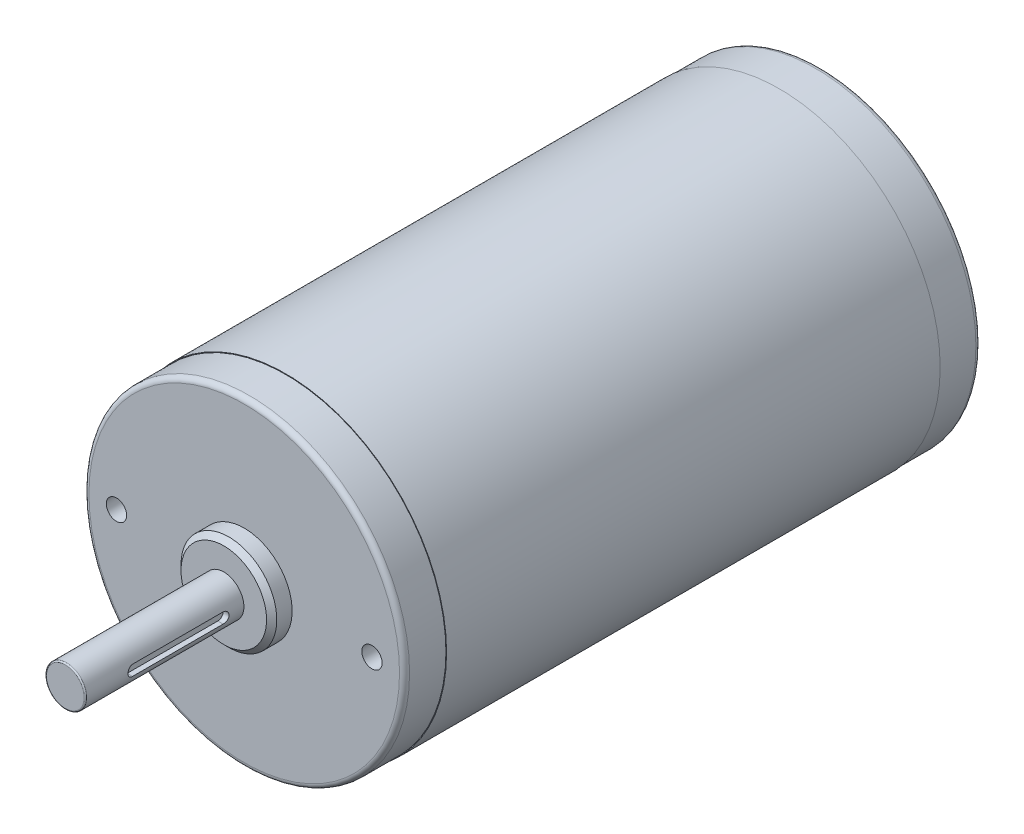
ISO-10303-21;
HEADER;
FILE_DESCRIPTION(('STEP AP214'),'2;1');
FILE_NAME('part.step','',(''),(''),'','','');
FILE_SCHEMA(('AUTOMOTIVE_DESIGN { 1 0 10303 214 1 1 1 1 }'));
ENDSEC;
DATA;
#1=APPLICATION_CONTEXT('core data for automotive mechanical design processes');
#2=APPLICATION_PROTOCOL_DEFINITION('international standard','automotive_design',2000,#1);
#3=PRODUCT_CONTEXT('',#1,'mechanical');
#4=PRODUCT('Part','Part','',(#3));
#5=PRODUCT_RELATED_PRODUCT_CATEGORY('part','',(#4));
#6=PRODUCT_DEFINITION_FORMATION('','',#4);
#7=PRODUCT_DEFINITION_CONTEXT('part definition',#1,'design');
#8=PRODUCT_DEFINITION('design','',#6,#7);
#9=PRODUCT_DEFINITION_SHAPE('','',#8);
#10=(LENGTH_UNIT() NAMED_UNIT(*) SI_UNIT(.MILLI.,.METRE.));
#11=(NAMED_UNIT(*) PLANE_ANGLE_UNIT() SI_UNIT($,.RADIAN.));
#12=(NAMED_UNIT(*) SI_UNIT($,.STERADIAN.) SOLID_ANGLE_UNIT());
#13=UNCERTAINTY_MEASURE_WITH_UNIT(LENGTH_MEASURE(1.E-05),#10,'distance_accuracy_value','');
#14=(GEOMETRIC_REPRESENTATION_CONTEXT(3) GLOBAL_UNCERTAINTY_ASSIGNED_CONTEXT((#13)) GLOBAL_UNIT_ASSIGNED_CONTEXT((#10,
#11,#12)) REPRESENTATION_CONTEXT('',''));
#15=CARTESIAN_POINT('',(0.,0.,0.));
#16=DIRECTION('',(0.,0.,1.));
#17=DIRECTION('',(1.,0.,0.));
#18=AXIS2_PLACEMENT_3D('',#15,#16,#17);
#19=CARTESIAN_POINT('',(35.56,109.2962,54.614));
#20=DIRECTION('',(0.,0.,1.));
#21=DIRECTION('',(1.,0.,0.));
#22=AXIS2_PLACEMENT_3D('',#19,#20,#21);
#23=PLANE('',#22);
#24=CARTESIAN_POINT('',(35.56,109.2962,54.614));
#25=DIRECTION('',(0.,0.,-1.));
#26=DIRECTION('',(-1.,0.,0.));
#27=AXIS2_PLACEMENT_3D('',#24,#25,#26);
#28=CIRCLE('',#27,3.74600000000008);
#29=CARTESIAN_POINT('',(31.8139999999999,109.2962,54.614));
#30=VERTEX_POINT('',#29);
#31=CARTESIAN_POINT('',(39.3060000000001,109.2962,54.614));
#32=VERTEX_POINT('',#31);
#33=EDGE_CURVE('E126',#30,#32,#28,.T.);
#34=ORIENTED_EDGE('',*,*,#33,.F.);
#35=CARTESIAN_POINT('',(35.56,109.2962,54.614));
#36=DIRECTION('',(0.,0.,-1.));
#37=DIRECTION('',(1.,0.,0.));
#38=AXIS2_PLACEMENT_3D('',#35,#36,#37);
#39=CIRCLE('',#38,3.74600000000008);
#40=EDGE_CURVE('E116',#32,#30,#39,.T.);
#41=ORIENTED_EDGE('',*,*,#40,.F.);
#42=EDGE_LOOP('',(#34,#41));
#43=FACE_BOUND('',#42,.T.);
#44=ADVANCED_FACE('F21',(#43),#23,.T.);
#45=CARTESIAN_POINT('',(38.3600000000001,109.2962,16.4984772078548));
#46=DIRECTION('',(1.,0.,0.));
#47=DIRECTION('',(0.,0.,-1.));
#48=AXIS2_PLACEMENT_3D('',#45,#46,#47);
#49=PLANE('',#48);
#50=DIRECTION('',(0.,0.,1.));
#51=VECTOR('',#50,1.);
#52=CARTESIAN_POINT('',(38.3600000000001,108.2462,16.4984772078548));
#53=LINE('',#52,#51);
#54=CARTESIAN_POINT('',(38.3600000000001,108.2462,27.1));
#55=VERTEX_POINT('',#54);
#56=CARTESIAN_POINT('',(38.3600000000001,108.2462,45.1));
#57=VERTEX_POINT('',#56);
#58=EDGE_CURVE('E110',#55,#57,#53,.T.);
#59=ORIENTED_EDGE('',*,*,#58,.F.);
#60=CARTESIAN_POINT('',(38.3600000000001,109.2962,27.1));
#61=DIRECTION('',(1.,0.,0.));
#62=DIRECTION('',(0.,0.,-1.));
#63=AXIS2_PLACEMENT_3D('',#60,#61,#62);
#64=CIRCLE('',#63,1.05);
#65=CARTESIAN_POINT('',(38.3600000000001,110.3462,27.1));
#66=VERTEX_POINT('',#65);
#67=EDGE_CURVE('E99',#55,#66,#64,.T.);
#68=ORIENTED_EDGE('',*,*,#67,.T.);
#69=DIRECTION('',(0.,0.,1.));
#70=VECTOR('',#69,1.);
#71=CARTESIAN_POINT('',(38.3600000000001,110.3462,16.4984772078548));
#72=LINE('',#71,#70);
#73=CARTESIAN_POINT('',(38.3600000000001,110.3462,45.1));
#74=VERTEX_POINT('',#73);
#75=EDGE_CURVE('E130',#66,#74,#72,.T.);
#76=ORIENTED_EDGE('',*,*,#75,.T.);
#77=CARTESIAN_POINT('',(38.3600000000001,109.2962,45.1));
#78=DIRECTION('',(-1.,0.,0.));
#79=DIRECTION('',(0.,0.,1.));
#80=AXIS2_PLACEMENT_3D('',#77,#78,#79);
#81=CIRCLE('',#80,1.05);
#82=EDGE_CURVE('E93',#74,#57,#81,.F.);
#83=ORIENTED_EDGE('',*,*,#82,.T.);
#84=EDGE_LOOP('',(#59,#68,#76,#83));
#85=FACE_BOUND('',#84,.T.);
#86=ADVANCED_FACE('F111',(#85),#49,.T.);
#87=CARTESIAN_POINT('',(38.3600000000001,108.2462,16.4984772078548));
#88=DIRECTION('',(0.,1.,0.));
#89=DIRECTION('',(0.,0.,1.));
#90=AXIS2_PLACEMENT_3D('',#87,#88,#89);
#91=PLANE('',#90);
#92=DIRECTION('',(0.,0.,-1.));
#93=VECTOR('',#92,1.);
#94=CARTESIAN_POINT('',(39.4197279696891,108.2462,54.614));
#95=LINE('',#94,#93);
#96=CARTESIAN_POINT('',(39.4197279696891,108.2462,27.1));
#97=VERTEX_POINT('',#96);
#98=CARTESIAN_POINT('',(39.4197279696891,108.2462,45.1));
#99=VERTEX_POINT('',#98);
#100=EDGE_CURVE('E120',#97,#99,#95,.F.);
#101=ORIENTED_EDGE('',*,*,#100,.F.);
#102=DIRECTION('',(1.,0.,0.));
#103=VECTOR('',#102,1.);
#104=CARTESIAN_POINT('',(38.3600000000001,108.2462,27.1));
#105=LINE('',#104,#103);
#106=EDGE_CURVE('E103',#97,#55,#105,.F.);
#107=ORIENTED_EDGE('',*,*,#106,.T.);
#108=ORIENTED_EDGE('',*,*,#58,.T.);
#109=DIRECTION('',(1.,0.,0.));
#110=VECTOR('',#109,1.);
#111=CARTESIAN_POINT('',(38.3600000000001,108.2462,45.1));
#112=LINE('',#111,#110);
#113=EDGE_CURVE('E122',#57,#99,#112,.T.);
#114=ORIENTED_EDGE('',*,*,#113,.T.);
#115=EDGE_LOOP('',(#101,#107,#108,#114));
#116=FACE_BOUND('',#115,.T.);
#117=ADVANCED_FACE('F118',(#116),#91,.T.);
#118=CARTESIAN_POINT('',(35.56,109.2962,54.36));
#119=DIRECTION('',(0.,0.,1.));
#120=DIRECTION('',(1.,0.,0.));
#121=AXIS2_PLACEMENT_3D('',#118,#119,#120);
#122=TOROIDAL_SURFACE('',#121,3.74600000000008,0.254);
#123=ORIENTED_EDGE('',*,*,#40,.T.);
#124=ORIENTED_EDGE('',*,*,#33,.T.);
#125=EDGE_LOOP('',(#123,#124));
#126=FACE_BOUND('',#125,.T.);
#127=CARTESIAN_POINT('',(35.56,109.2962,54.36));
#128=DIRECTION('',(0.,0.,-1.));
#129=DIRECTION('',(-1.,0.,0.));
#130=AXIS2_PLACEMENT_3D('',#127,#128,#129);
#131=CIRCLE('',#130,4.00000000000007);
#132=CARTESIAN_POINT('',(31.5599999999999,109.2962,54.36));
#133=VERTEX_POINT('',#132);
#134=EDGE_CURVE('E419',#133,#133,#131,.T.);
#135=ORIENTED_EDGE('',*,*,#134,.F.);
#136=EDGE_LOOP('',(#135));
#137=FACE_BOUND('',#136,.T.);
#138=ADVANCED_FACE('F160',(#126,#137),#122,.T.);
#139=CARTESIAN_POINT('',(38.3600000000001,109.2962,45.1));
#140=DIRECTION('',(-1.,0.,0.));
#141=DIRECTION('',(0.,0.,1.));
#142=AXIS2_PLACEMENT_3D('',#139,#140,#141);
#143=CYLINDRICAL_SURFACE('',#142,1.05);
#144=DIRECTION('',(1.,0.,0.));
#145=VECTOR('',#144,1.);
#146=CARTESIAN_POINT('',(38.3600000000001,110.3462,45.1));
#147=LINE('',#146,#145);
#148=CARTESIAN_POINT('',(39.4197279696891,110.3462,45.1));
#149=VERTEX_POINT('',#148);
#150=EDGE_CURVE('E108',#74,#149,#147,.T.);
#151=ORIENTED_EDGE('',*,*,#150,.T.);
#152=CARTESIAN_POINT('',(39.4197279696891,108.2462,45.1));
#153=CARTESIAN_POINT('',(39.4197258950768,108.24619958975,45.1289948990377));
#154=CARTESIAN_POINT('',(39.4200551064328,108.247401772744,45.1579753771942));
#155=CARTESIAN_POINT('',(39.4213547123988,108.252193790165,45.2157185717611));
#156=CARTESIAN_POINT('',(39.4223249908093,108.255783191888,45.2444813266804));
#157=CARTESIAN_POINT('',(39.4261578920524,108.270078067236,45.3300048839447));
#158=CARTESIAN_POINT('',(39.4299428342912,108.284310457697,45.3861763507014));
#159=CARTESIAN_POINT('',(39.4395286889104,108.321713164946,45.4952257963179));
#160=CARTESIAN_POINT('',(39.445329326456,108.344882263286,45.5481042230163));
#161=CARTESIAN_POINT('',(39.4582892232805,108.399469503916,45.6492511443793));
#162=CARTESIAN_POINT('',(39.4654488628844,108.430889956344,45.6975183428654));
#163=CARTESIAN_POINT('',(39.4805119710478,108.501890363002,45.7892077701155));
#164=CARTESIAN_POINT('',(39.4884281885094,108.541632256913,45.8325024671448));
#165=CARTESIAN_POINT('',(39.5040047400555,108.627813145963,45.9119068745175));
#166=CARTESIAN_POINT('',(39.5116649818293,108.67425452566,45.9480140156475));
#167=CARTESIAN_POINT('',(39.526010604883,108.773412379805,46.0125503896214));
#168=CARTESIAN_POINT('',(39.5326785635433,108.826216831296,46.040848518688));
#169=CARTESIAN_POINT('',(39.5441298010583,108.936002054238,46.0880888400132));
#170=CARTESIAN_POINT('',(39.5489153447307,108.992977708579,46.1070422822868));
#171=CARTESIAN_POINT('',(39.5549473168842,109.091228422711,46.1306241727345));
#172=CARTESIAN_POINT('',(39.5568321627736,109.13185376544,46.1378772746766));
#173=CARTESIAN_POINT('',(39.5593590428507,109.213713896391,46.147566034752));
#174=CARTESIAN_POINT('',(39.560001100914,109.254948672889,46.1500017854335));
#175=CARTESIAN_POINT('',(39.5599984549201,109.354094261643,46.1499974942296));
#176=CARTESIAN_POINT('',(39.5587300938834,109.412021122661,46.1451938276971));
#177=CARTESIAN_POINT('',(39.5537908073877,109.526225171743,46.1261319193829));
#178=CARTESIAN_POINT('',(39.5501176251492,109.582500758305,46.1118647965529));
#179=CARTESIAN_POINT('',(39.5407752151886,109.691711041936,46.0743710095572));
#180=CARTESIAN_POINT('',(39.5351088856793,109.744650458997,46.051157349786));
#181=CARTESIAN_POINT('',(39.5223803452478,109.845880148194,45.9964722913931));
#182=CARTESIAN_POINT('',(39.5153181479083,109.894170465564,45.9650009731229));
#183=CARTESIAN_POINT('',(39.5003832391547,109.985824414736,45.8939447079381));
#184=CARTESIAN_POINT('',(39.4924970081334,110.029068444468,45.8542083308329));
#185=CARTESIAN_POINT('',(39.4768899553604,110.108363690847,45.768070017791));
#186=CARTESIAN_POINT('',(39.4691691622905,110.144413669136,45.7216669366335));
#187=CARTESIAN_POINT('',(39.4546281048764,110.208880604601,45.6225587145474));
#188=CARTESIAN_POINT('',(39.447825217303,110.237158627992,45.5697605148942));
#189=CARTESIAN_POINT('',(39.4360941322255,110.284374941225,45.4599645484902));
#190=CARTESIAN_POINT('',(39.4311644713835,110.303320524877,45.4029701015121));
#191=CARTESIAN_POINT('',(39.424947536189,110.326869937927,45.3047298343336));
#192=CARTESIAN_POINT('',(39.4230031721686,110.334106552333,45.2641375466187));
#193=CARTESIAN_POINT('',(39.4203876966156,110.343775049367,45.1823710409093));
#194=CARTESIAN_POINT('',(39.419715789786,110.346209933161,45.141197202614));
#195=CARTESIAN_POINT('',(39.4197279696891,110.3462,45.1));
#196=B_SPLINE_CURVE_WITH_KNOTS('',3,(#152,#153,#154,#155,#156,#157,#158,#159,#160,#161,#162,
#163,#164,#165,#166,#167,#168,#169,#170,#171,#172,#173,#174,#175,#176,#177,#178,#179,#180,#181,
#182,#183,#184,#185,#186,#187,#188,#189,#190,#191,#192,#193,#194,#195),.UNSPECIFIED.,.F.,.F.,(4,
2,2,2,2,2,2,2,2,2,2,2,2,2,2,2,2,2,2,2,2,4),(0.,0.0869295778834422,0.17384340328612,
0.347151826879625,0.520436629596116,0.69376999881019,0.870856390838584,1.04800596970821,
1.22797015523126,1.40771715061754,1.53136439682193,1.65500926755904,1.82853892099362,
2.0022316554156,2.17567286221397,2.34911238140169,2.52606492372393,2.70304789975981,
2.88301467869373,3.0628405797152,3.18638852057382,3.3098592173462),.UNSPECIFIED.);
#197=EDGE_CURVE('E206',#99,#149,#196,.T.);
#198=ORIENTED_EDGE('',*,*,#197,.F.);
#199=ORIENTED_EDGE('',*,*,#113,.F.);
#200=ORIENTED_EDGE('',*,*,#82,.F.);
#201=EDGE_LOOP('',(#151,#198,#199,#200));
#202=FACE_BOUND('',#201,.T.);
#203=ADVANCED_FACE('F170',(#202),#143,.F.);
#204=CARTESIAN_POINT('',(38.3600000000001,110.3462,16.4984772078548));
#205=DIRECTION('',(0.,1.,0.));
#206=DIRECTION('',(0.,0.,1.));
#207=AXIS2_PLACEMENT_3D('',#204,#205,#206);
#208=PLANE('',#207);
#209=ORIENTED_EDGE('',*,*,#150,.F.);
#210=ORIENTED_EDGE('',*,*,#75,.F.);
#211=DIRECTION('',(1.,0.,0.));
#212=VECTOR('',#211,1.);
#213=CARTESIAN_POINT('',(38.3600000000001,110.3462,27.1));
#214=LINE('',#213,#212);
#215=CARTESIAN_POINT('',(39.4197279696891,110.3462,27.1));
#216=VERTEX_POINT('',#215);
#217=EDGE_CURVE('E105',#66,#216,#214,.T.);
#218=ORIENTED_EDGE('',*,*,#217,.T.);
#219=DIRECTION('',(0.,0.,-1.));
#220=VECTOR('',#219,1.);
#221=CARTESIAN_POINT('',(39.4197279696891,110.3462,54.614));
#222=LINE('',#221,#220);
#223=EDGE_CURVE('E205',#149,#216,#222,.T.);
#224=ORIENTED_EDGE('',*,*,#223,.F.);
#225=EDGE_LOOP('',(#209,#210,#218,#224));
#226=FACE_BOUND('',#225,.T.);
#227=ADVANCED_FACE('F847',(#226),#208,.F.);
#228=CARTESIAN_POINT('',(38.3600000000001,109.2962,27.1));
#229=DIRECTION('',(1.,0.,0.));
#230=DIRECTION('',(0.,0.,-1.));
#231=AXIS2_PLACEMENT_3D('',#228,#229,#230);
#232=CYLINDRICAL_SURFACE('',#231,1.05);
#233=ORIENTED_EDGE('',*,*,#67,.F.);
#234=ORIENTED_EDGE('',*,*,#106,.F.);
#235=CARTESIAN_POINT('',(39.4197279696891,110.3462,27.1));
#236=CARTESIAN_POINT('',(39.4197258950768,110.34620041025,27.0710051009623));
#237=CARTESIAN_POINT('',(39.4200551064329,110.344998227256,27.0420246228058));
#238=CARTESIAN_POINT('',(39.4213547123988,110.340206209835,26.9842814282389));
#239=CARTESIAN_POINT('',(39.4223249908093,110.336616808112,26.9555186733196));
#240=CARTESIAN_POINT('',(39.4261578920524,110.322321932764,26.8699951160553));
#241=CARTESIAN_POINT('',(39.4299428342912,110.308089542303,26.8138236492985));
#242=CARTESIAN_POINT('',(39.4395286889104,110.270686835054,26.7047742036821));
#243=CARTESIAN_POINT('',(39.445329326456,110.247517736714,26.6518957769836));
#244=CARTESIAN_POINT('',(39.4582892232805,110.192930496084,26.5507488556207));
#245=CARTESIAN_POINT('',(39.4654488628844,110.161510043656,26.5024816571346));
#246=CARTESIAN_POINT('',(39.4805119710478,110.090509636998,26.4107922298844));
#247=CARTESIAN_POINT('',(39.4884281885094,110.050767743087,26.3674975328551));
#248=CARTESIAN_POINT('',(39.5040047400555,109.964586854037,26.2880931254825));
#249=CARTESIAN_POINT('',(39.5116649818293,109.91814547434,26.2519859843525));
#250=CARTESIAN_POINT('',(39.526010604883,109.818987620195,26.1874496103786));
#251=CARTESIAN_POINT('',(39.5326785635433,109.766183168704,26.159151481312));
#252=CARTESIAN_POINT('',(39.5441298010583,109.656397945762,26.1119111599868));
#253=CARTESIAN_POINT('',(39.5489153447307,109.599422291421,26.0929577177131));
#254=CARTESIAN_POINT('',(39.5549473168842,109.501171577289,26.0693758272655));
#255=CARTESIAN_POINT('',(39.5568321627736,109.46054623456,26.0621227253234));
#256=CARTESIAN_POINT('',(39.5593590428507,109.378686103609,26.052433965248));
#257=CARTESIAN_POINT('',(39.560001100914,109.337451327111,26.0499982145665));
#258=CARTESIAN_POINT('',(39.5599984549201,109.238305738357,26.0500025057704));
#259=CARTESIAN_POINT('',(39.5587300938834,109.18037887734,26.0548061723029));
#260=CARTESIAN_POINT('',(39.5537908073877,109.066174828257,26.0738680806171));
#261=CARTESIAN_POINT('',(39.5501176251492,109.009899241695,26.0881352034471));
#262=CARTESIAN_POINT('',(39.5407752151886,108.900688958064,26.1256289904428));
#263=CARTESIAN_POINT('',(39.5351088856793,108.847749541003,26.148842650214));
#264=CARTESIAN_POINT('',(39.5223803452478,108.746519851806,26.2035277086069));
#265=CARTESIAN_POINT('',(39.5153181479083,108.698229534436,26.2349990268771));
#266=CARTESIAN_POINT('',(39.5003832391547,108.606575585264,26.3060552920619));
#267=CARTESIAN_POINT('',(39.4924970081334,108.563331555532,26.3457916691671));
#268=CARTESIAN_POINT('',(39.4768899553604,108.484036309153,26.431929982209));
#269=CARTESIAN_POINT('',(39.4691691622905,108.447986330864,26.4783330633665));
#270=CARTESIAN_POINT('',(39.4546281048764,108.383519395399,26.5774412854526));
#271=CARTESIAN_POINT('',(39.447825217303,108.355241372008,26.6302394851058));
#272=CARTESIAN_POINT('',(39.4360941322255,108.308025058775,26.7400354515098));
#273=CARTESIAN_POINT('',(39.4311644713835,108.289079475123,26.7970298984879));
#274=CARTESIAN_POINT('',(39.424947536189,108.265530062073,26.8952701656664));
#275=CARTESIAN_POINT('',(39.4230031721686,108.258293447667,26.9358624533813));
#276=CARTESIAN_POINT('',(39.4203876966156,108.248624950633,27.0176289590907));
#277=CARTESIAN_POINT('',(39.419715789786,108.246190066839,27.058802797386));
#278=CARTESIAN_POINT('',(39.4197279696891,108.2462,27.1));
#279=B_SPLINE_CURVE_WITH_KNOTS('',3,(#235,#236,#237,#238,#239,#240,#241,#242,#243,#244,#245,
#246,#247,#248,#249,#250,#251,#252,#253,#254,#255,#256,#257,#258,#259,#260,#261,#262,#263,#264,
#265,#266,#267,#268,#269,#270,#271,#272,#273,#274,#275,#276,#277,#278),.UNSPECIFIED.,.F.,.F.,(4,
2,2,2,2,2,2,2,2,2,2,2,2,2,2,2,2,2,2,2,2,4),(0.,0.0869295778834455,0.173843403286115,
0.347151826879623,0.520436629596136,0.693769998810197,0.870856390838592,1.0480059697082,
1.22797015523124,1.40771715061754,1.53136439682191,1.65500926755904,1.82853892099358,
2.00223165541559,2.17567286221396,2.34911238140168,2.52606492372391,2.7030478997598,
2.88301467869372,3.06284057971519,3.18638852057381,3.30985921734618),.UNSPECIFIED.);
#280=EDGE_CURVE('E195',#216,#97,#279,.T.);
#281=ORIENTED_EDGE('',*,*,#280,.F.);
#282=ORIENTED_EDGE('',*,*,#217,.F.);
#283=EDGE_LOOP('',(#233,#234,#281,#282));
#284=FACE_BOUND('',#283,.T.);
#285=ADVANCED_FACE('F100',(#284),#232,.F.);
#286=CARTESIAN_POINT('',(35.56,109.2962,54.614));
#287=DIRECTION('',(0.,0.,-1.));
#288=DIRECTION('',(-1.,0.,0.));
#289=AXIS2_PLACEMENT_3D('',#286,#287,#288);
#290=CYLINDRICAL_SURFACE('',#289,4.00000000000007);
#291=ORIENTED_EDGE('',*,*,#100,.T.);
#292=ORIENTED_EDGE('',*,*,#197,.T.);
#293=ORIENTED_EDGE('',*,*,#223,.T.);
#294=ORIENTED_EDGE('',*,*,#280,.T.);
#295=EDGE_LOOP('',(#291,#292,#293,#294));
#296=FACE_BOUND('',#295,.T.);
#297=CARTESIAN_POINT('',(35.56,109.2962,23.114));
#298=DIRECTION('',(0.,0.,-1.));
#299=DIRECTION('',(-1.,0.,0.));
#300=AXIS2_PLACEMENT_3D('',#297,#298,#299);
#301=CIRCLE('',#300,4.00000000000007);
#302=CARTESIAN_POINT('',(31.5599999999999,109.2962,23.114));
#303=VERTEX_POINT('',#302);
#304=EDGE_CURVE('E188',#303,#303,#301,.T.);
#305=ORIENTED_EDGE('',*,*,#304,.F.);
#306=EDGE_LOOP('',(#305));
#307=FACE_BOUND('',#306,.T.);
#308=ORIENTED_EDGE('',*,*,#134,.T.);
#309=EDGE_LOOP('',(#308));
#310=FACE_BOUND('',#309,.T.);
#311=ADVANCED_FACE('F211',(#296,#307,#310),#290,.T.);
#312=CARTESIAN_POINT('',(35.56,109.2962,23.114));
#313=DIRECTION('',(0.,0.,1.));
#314=DIRECTION('',(1.,0.,0.));
#315=AXIS2_PLACEMENT_3D('',#312,#313,#314);
#316=PLANE('',#315);
#317=ORIENTED_EDGE('',*,*,#304,.T.);
#318=EDGE_LOOP('',(#317));
#319=FACE_BOUND('',#318,.T.);
#320=CARTESIAN_POINT('',(35.56,109.2962,23.114));
#321=DIRECTION('',(0.,0.,-1.));
#322=DIRECTION('',(-1.,0.,0.));
#323=AXIS2_PLACEMENT_3D('',#320,#321,#322);
#324=CIRCLE('',#323,8.50900000182337);
#325=CARTESIAN_POINT('',(27.0509999981766,109.2962,23.114));
#326=VERTEX_POINT('',#325);
#327=EDGE_CURVE('E194',#326,#326,#324,.T.);
#328=ORIENTED_EDGE('',*,*,#327,.F.);
#329=EDGE_LOOP('',(#328));
#330=FACE_BOUND('',#329,.T.);
#331=ADVANCED_FACE('F215',(#319,#330),#316,.T.);
#332=CARTESIAN_POINT('',(48.8853596371201,127.903290682857,-97.8026999980236));
#333=DIRECTION('',(0.,0.,-1.));
#334=DIRECTION('',(-1.,0.,0.));
#335=AXIS2_PLACEMENT_3D('',#332,#333,#334);
#336=PLANE('',#335);
#337=CARTESIAN_POINT('',(46.76735963712,127.903290682857,-97.8026999979988));
#338=DIRECTION('',(0.,0.,1.));
#339=DIRECTION('',(0.,-1.,0.));
#340=AXIS2_PLACEMENT_3D('',#337,#338,#339);
#341=CIRCLE('',#340,2.11800000003411);
#342=CARTESIAN_POINT('',(46.76735963712,125.785290682823,-97.8026999979988));
#343=VERTEX_POINT('',#342);
#344=EDGE_CURVE('E320',#343,#343,#341,.T.);
#345=ORIENTED_EDGE('',*,*,#344,.F.);
#346=EDGE_LOOP('',(#345));
#347=FACE_BOUND('',#346,.T.);
#348=ADVANCED_FACE('F220',(#347),#336,.T.);
#349=CARTESIAN_POINT('',(56.2850906808811,120.503559639096,-97.8026999980238));
#350=DIRECTION('',(0.,0.,-1.));
#351=DIRECTION('',(-1.,0.,0.));
#352=AXIS2_PLACEMENT_3D('',#349,#350,#351);
#353=PLANE('',#352);
#354=CARTESIAN_POINT('',(54.1670906808811,120.503559639096,-97.8026999980557));
#355=DIRECTION('',(0.,0.,1.));
#356=DIRECTION('',(0.,-1.,0.));
#357=AXIS2_PLACEMENT_3D('',#354,#355,#356);
#358=CIRCLE('',#357,2.11799999994966);
#359=CARTESIAN_POINT('',(54.1670906808811,118.385559639146,-97.8026999980557));
#360=VERTEX_POINT('',#359);
#361=EDGE_CURVE('E315',#360,#360,#358,.T.);
#362=ORIENTED_EDGE('',*,*,#361,.F.);
#363=EDGE_LOOP('',(#362));
#364=FACE_BOUND('',#363,.T.);
#365=ADVANCED_FACE('F224',(#364),#353,.T.);
#366=CARTESIAN_POINT('',(35.56,109.2962,-100.317299999998));
#367=DIRECTION('',(0.,0.,-1.));
#368=DIRECTION('',(-1.,0.,0.));
#369=AXIS2_PLACEMENT_3D('',#366,#367,#368);
#370=PLANE('',#369);
#371=CARTESIAN_POINT('',(35.56,109.2962,-100.317299999998));
#372=DIRECTION('',(0.,0.,1.));
#373=DIRECTION('',(1.,0.,0.));
#374=AXIS2_PLACEMENT_3D('',#371,#372,#373);
#375=CIRCLE('',#374,14.0368000000003);
#376=CARTESIAN_POINT('',(49.5968000000003,109.2962,-100.317299999998));
#377=VERTEX_POINT('',#376);
#378=CARTESIAN_POINT('',(21.5231999999997,109.2962,-100.317299999998));
#379=VERTEX_POINT('',#378);
#380=EDGE_CURVE('E254',#377,#379,#375,.T.);
#381=ORIENTED_EDGE('',*,*,#380,.F.);
#382=CARTESIAN_POINT('',(35.56,109.2962,-100.317299999998));
#383=DIRECTION('',(0.,0.,1.));
#384=DIRECTION('',(-1.,0.,0.));
#385=AXIS2_PLACEMENT_3D('',#382,#383,#384);
#386=CIRCLE('',#385,14.0368000000003);
#387=EDGE_CURVE('E319',#379,#377,#386,.T.);
#388=ORIENTED_EDGE('',*,*,#387,.F.);
#389=EDGE_LOOP('',(#381,#388));
#390=FACE_BOUND('',#389,.T.);
#391=ADVANCED_FACE('F228',(#390),#370,.T.);
#392=CARTESIAN_POINT('',(10.1599999999994,109.2962,5.43560000011212));
#393=DIRECTION('',(0.,0.,1.));
#394=DIRECTION('',(1.,0.,0.));
#395=AXIS2_PLACEMENT_3D('',#392,#393,#394);
#396=CONICAL_SURFACE('',#395,2.01930000012817,1.02974425747654);
#397=CARTESIAN_POINT('',(10.1600000000133,109.2962,4.22228214875986));
#398=VERTEX_POINT('',#397);
#399=VERTEX_LOOP('',#398);
#400=FACE_BOUND('',#399,.T.);
#401=CARTESIAN_POINT('',(10.1599999999994,109.2962,5.4356000000007));
#402=DIRECTION('',(0.,0.,1.));
#403=DIRECTION('',(1.,0.,0.));
#404=AXIS2_PLACEMENT_3D('',#401,#402,#403);
#405=CIRCLE('',#404,2.01930000000003);
#406=CARTESIAN_POINT('',(12.1792999999994,109.2962,5.4356000000007));
#407=VERTEX_POINT('',#406);
#408=EDGE_CURVE('E433',#407,#407,#405,.T.);
#409=ORIENTED_EDGE('',*,*,#408,.T.);
#410=EDGE_LOOP('',(#409));
#411=FACE_BOUND('',#410,.T.);
#412=ADVANCED_FACE('F233',(#400,#411),#396,.F.);
#413=CARTESIAN_POINT('',(60.96,109.2962,5.43559999994159));
#414=DIRECTION('',(0.,0.,1.));
#415=DIRECTION('',(1.,0.,0.));
#416=AXIS2_PLACEMENT_3D('',#413,#414,#415);
#417=CONICAL_SURFACE('',#416,2.01929999988128,1.02974425744088);
#418=CARTESIAN_POINT('',(60.9599999998807,109.2962,4.22228214875986));
#419=VERTEX_POINT('',#418);
#420=VERTEX_LOOP('',#419);
#421=FACE_BOUND('',#420,.T.);
#422=CARTESIAN_POINT('',(60.96,109.2962,5.43560000000074));
#423=DIRECTION('',(0.,0.,1.));
#424=DIRECTION('',(1.,0.,0.));
#425=AXIS2_PLACEMENT_3D('',#422,#423,#424);
#426=CIRCLE('',#425,2.01930000000003);
#427=CARTESIAN_POINT('',(62.9793,109.2962,5.43560000000074));
#428=VERTEX_POINT('',#427);
#429=EDGE_CURVE('E437',#428,#428,#426,.T.);
#430=ORIENTED_EDGE('',*,*,#429,.T.);
#431=EDGE_LOOP('',(#430));
#432=FACE_BOUND('',#431,.T.);
#433=ADVANCED_FACE('F337',(#421,#432),#417,.F.);
#434=CARTESIAN_POINT('',(35.56,109.2962,22.0979999999996));
#435=DIRECTION('',(0.,0.,-1.));
#436=DIRECTION('',(-1.,0.,0.));
#437=AXIS2_PLACEMENT_3D('',#434,#435,#436);
#438=CONICAL_SURFACE('',#437,9.52500000000019,0.785398162500005);
#439=CARTESIAN_POINT('',(35.56,109.2962,22.0979999999996));
#440=DIRECTION('',(0.,0.,-1.));
#441=DIRECTION('',(-1.,0.,0.));
#442=AXIS2_PLACEMENT_3D('',#439,#440,#441);
#443=CIRCLE('',#442,9.52500000000019);
#444=CARTESIAN_POINT('',(26.0349999999998,109.2962,22.0979999999996));
#445=VERTEX_POINT('',#444);
#446=EDGE_CURVE('E449',#445,#445,#443,.T.);
#447=ORIENTED_EDGE('',*,*,#446,.F.);
#448=EDGE_LOOP('',(#447));
#449=FACE_BOUND('',#448,.T.);
#450=ORIENTED_EDGE('',*,*,#327,.T.);
#451=EDGE_LOOP('',(#450));
#452=FACE_BOUND('',#451,.T.);
#453=ADVANCED_FACE('F333',(#449,#452),#438,.T.);
#454=CARTESIAN_POINT('',(46.76735963712,127.903290682857,-95.6026999959931));
#455=DIRECTION('',(0.,0.,1.));
#456=DIRECTION('',(0.,-1.,0.));
#457=AXIS2_PLACEMENT_3D('',#454,#455,#456);
#458=CONICAL_SURFACE('',#457,4.31800000198298,0.785398163384529);
#459=CARTESIAN_POINT('',(46.76735963712,127.903290682857,-95.6026999960491));
#460=DIRECTION('',(0.,0.,1.));
#461=DIRECTION('',(1.,0.,0.));
#462=AXIS2_PLACEMENT_3D('',#459,#460,#461);
#463=CIRCLE('',#462,4.3180000019745);
#464=CARTESIAN_POINT('',(51.0853596390945,127.903290682857,-95.6026999960491));
#465=VERTEX_POINT('',#464);
#466=EDGE_CURVE('E288',#465,#465,#463,.T.);
#467=ORIENTED_EDGE('',*,*,#466,.F.);
#468=EDGE_LOOP('',(#467));
#469=FACE_BOUND('',#468,.T.);
#470=ORIENTED_EDGE('',*,*,#344,.T.);
#471=EDGE_LOOP('',(#470));
#472=FACE_BOUND('',#471,.T.);
#473=ADVANCED_FACE('F336',(#469,#472),#458,.T.);
#474=CARTESIAN_POINT('',(54.1670906808811,120.503559639096,-95.6026999961637));
#475=DIRECTION('',(0.,0.,1.));
#476=DIRECTION('',(0.,-1.,0.));
#477=AXIS2_PLACEMENT_3D('',#474,#475,#476);
#478=CONICAL_SURFACE('',#477,4.31800000184168,0.785398163397448);
#479=CARTESIAN_POINT('',(54.1670906808811,120.503559639096,-95.6026999960494));
#480=DIRECTION('',(0.,0.,1.));
#481=DIRECTION('',(1.,0.,0.));
#482=AXIS2_PLACEMENT_3D('',#479,#480,#481);
#483=CIRCLE('',#482,4.31800000197446);
#484=CARTESIAN_POINT('',(58.4850906828556,120.503559639096,-95.6026999960494));
#485=VERTEX_POINT('',#484);
#486=EDGE_CURVE('E283',#485,#485,#483,.T.);
#487=ORIENTED_EDGE('',*,*,#486,.F.);
#488=EDGE_LOOP('',(#487));
#489=FACE_BOUND('',#488,.T.);
#490=ORIENTED_EDGE('',*,*,#361,.T.);
#491=EDGE_LOOP('',(#490));
#492=FACE_BOUND('',#491,.T.);
#493=ADVANCED_FACE('F273',(#489,#492),#478,.T.);
#494=CARTESIAN_POINT('',(35.56,109.2962,-99.317299999998));
#495=DIRECTION('',(0.,0.,-1.));
#496=DIRECTION('',(-1.,0.,0.));
#497=AXIS2_PLACEMENT_3D('',#494,#495,#496);
#498=TOROIDAL_SURFACE('',#497,14.0368000000003,1.);
#499=ORIENTED_EDGE('',*,*,#387,.T.);
#500=ORIENTED_EDGE('',*,*,#380,.T.);
#501=EDGE_LOOP('',(#499,#500));
#502=FACE_BOUND('',#501,.T.);
#503=CARTESIAN_POINT('',(35.56,109.2962,-99.317299999998));
#504=DIRECTION('',(0.,0.,1.));
#505=DIRECTION('',(1.,0.,0.));
#506=AXIS2_PLACEMENT_3D('',#503,#504,#505);
#507=CIRCLE('',#506,15.0368000000003);
#508=CARTESIAN_POINT('',(50.5968000000003,109.2962,-99.317299999998));
#509=VERTEX_POINT('',#508);
#510=EDGE_CURVE('E280',#509,#509,#507,.T.);
#511=ORIENTED_EDGE('',*,*,#510,.F.);
#512=EDGE_LOOP('',(#511));
#513=FACE_BOUND('',#512,.T.);
#514=ADVANCED_FACE('F261',(#502,#513),#498,.T.);
#515=CARTESIAN_POINT('',(10.1599999999994,109.2962,19.05));
#516=DIRECTION('',(0.,0.,1.));
#517=DIRECTION('',(1.,0.,0.));
#518=AXIS2_PLACEMENT_3D('',#515,#516,#517);
#519=CYLINDRICAL_SURFACE('',#518,2.01930000000003);
#520=CARTESIAN_POINT('',(10.1599999999994,109.2962,19.05));
#521=DIRECTION('',(0.,0.,1.));
#522=DIRECTION('',(1.,0.,0.));
#523=AXIS2_PLACEMENT_3D('',#520,#521,#522);
#524=CIRCLE('',#523,2.01930000000003);
#525=CARTESIAN_POINT('',(12.1792999999994,109.2962,19.05));
#526=VERTEX_POINT('',#525);
#527=EDGE_CURVE('E311',#526,#526,#524,.F.);
#528=ORIENTED_EDGE('',*,*,#527,.F.);
#529=EDGE_LOOP('',(#528));
#530=FACE_BOUND('',#529,.T.);
#531=ORIENTED_EDGE('',*,*,#408,.F.);
#532=EDGE_LOOP('',(#531));
#533=FACE_BOUND('',#532,.T.);
#534=ADVANCED_FACE('F272',(#530,#533),#519,.F.);
#535=CARTESIAN_POINT('',(60.96,109.2962,19.05));
#536=DIRECTION('',(0.,0.,1.));
#537=DIRECTION('',(1.,0.,0.));
#538=AXIS2_PLACEMENT_3D('',#535,#536,#537);
#539=CYLINDRICAL_SURFACE('',#538,2.01930000000003);
#540=CARTESIAN_POINT('',(60.96,109.2962,19.05));
#541=DIRECTION('',(0.,0.,1.));
#542=DIRECTION('',(1.,0.,0.));
#543=AXIS2_PLACEMENT_3D('',#540,#541,#542);
#544=CIRCLE('',#543,2.01930000000003);
#545=CARTESIAN_POINT('',(62.9793,109.2962,19.05));
#546=VERTEX_POINT('',#545);
#547=EDGE_CURVE('E305',#546,#546,#544,.F.);
#548=ORIENTED_EDGE('',*,*,#547,.F.);
#549=EDGE_LOOP('',(#548));
#550=FACE_BOUND('',#549,.T.);
#551=ORIENTED_EDGE('',*,*,#429,.F.);
#552=EDGE_LOOP('',(#551));
#553=FACE_BOUND('',#552,.T.);
#554=ADVANCED_FACE('F456',(#550,#553),#539,.F.);
#555=CARTESIAN_POINT('',(35.56,109.2962,23.114));
#556=DIRECTION('',(0.,0.,-1.));
#557=DIRECTION('',(-1.,0.,0.));
#558=AXIS2_PLACEMENT_3D('',#555,#556,#557);
#559=CYLINDRICAL_SURFACE('',#558,9.52500000000019);
#560=CARTESIAN_POINT('',(35.56,109.2962,19.05));
#561=DIRECTION('',(0.,0.,-1.));
#562=DIRECTION('',(-1.,0.,0.));
#563=AXIS2_PLACEMENT_3D('',#560,#561,#562);
#564=CIRCLE('',#563,9.52500000000019);
#565=CARTESIAN_POINT('',(26.0349999999998,109.2962,19.05));
#566=VERTEX_POINT('',#565);
#567=EDGE_CURVE('E299',#566,#566,#564,.T.);
#568=ORIENTED_EDGE('',*,*,#567,.F.);
#569=EDGE_LOOP('',(#568));
#570=FACE_BOUND('',#569,.T.);
#571=ORIENTED_EDGE('',*,*,#446,.T.);
#572=EDGE_LOOP('',(#571));
#573=FACE_BOUND('',#572,.T.);
#574=ADVANCED_FACE('F458',(#570,#573),#559,.T.);
#575=CARTESIAN_POINT('',(46.76735963712,127.903290682857,-97.8026999980236));
#576=DIRECTION('',(0.,0.,1.));
#577=DIRECTION('',(1.,0.,0.));
#578=AXIS2_PLACEMENT_3D('',#575,#576,#577);
#579=CYLINDRICAL_SURFACE('',#578,4.3180000019745);
#580=CARTESIAN_POINT('',(46.76735963712,127.903290682857,-95.554799999998));
#581=DIRECTION('',(0.,0.,1.));
#582=DIRECTION('',(1.,0.,0.));
#583=AXIS2_PLACEMENT_3D('',#580,#581,#582);
#584=CIRCLE('',#583,4.3180000019745);
#585=CARTESIAN_POINT('',(51.0853596390945,127.903290682857,-95.554799999998));
#586=VERTEX_POINT('',#585);
#587=EDGE_CURVE('E304',#586,#586,#584,.T.);
#588=ORIENTED_EDGE('',*,*,#587,.F.);
#589=EDGE_LOOP('',(#588));
#590=FACE_BOUND('',#589,.T.);
#591=ORIENTED_EDGE('',*,*,#466,.T.);
#592=EDGE_LOOP('',(#591));
#593=FACE_BOUND('',#592,.T.);
#594=ADVANCED_FACE('F464',(#590,#593),#579,.T.);
#595=CARTESIAN_POINT('',(54.1670906808811,120.503559639096,-97.8026999980238));
#596=DIRECTION('',(0.,0.,1.));
#597=DIRECTION('',(1.,0.,0.));
#598=AXIS2_PLACEMENT_3D('',#595,#596,#597);
#599=CYLINDRICAL_SURFACE('',#598,4.31800000197446);
#600=CARTESIAN_POINT('',(54.1670906808811,120.503559639096,-95.554799999998));
#601=DIRECTION('',(0.,0.,1.));
#602=DIRECTION('',(1.,0.,0.));
#603=AXIS2_PLACEMENT_3D('',#600,#601,#602);
#604=CIRCLE('',#603,4.31800000197446);
#605=CARTESIAN_POINT('',(58.4850906828556,120.503559639096,-95.554799999998));
#606=VERTEX_POINT('',#605);
#607=EDGE_CURVE('E537',#606,#606,#604,.T.);
#608=ORIENTED_EDGE('',*,*,#607,.F.);
#609=EDGE_LOOP('',(#608));
#610=FACE_BOUND('',#609,.T.);
#611=ORIENTED_EDGE('',*,*,#486,.T.);
#612=EDGE_LOOP('',(#611));
#613=FACE_BOUND('',#612,.T.);
#614=ADVANCED_FACE('F472',(#610,#613),#599,.T.);
#615=CARTESIAN_POINT('',(35.56,109.2962,-100.317299999998));
#616=DIRECTION('',(0.,0.,1.));
#617=DIRECTION('',(1.,0.,0.));
#618=AXIS2_PLACEMENT_3D('',#615,#616,#617);
#619=CYLINDRICAL_SURFACE('',#618,15.0368000000003);
#620=CARTESIAN_POINT('',(35.56,109.2962,-95.554799999998));
#621=DIRECTION('',(0.,0.,1.));
#622=DIRECTION('',(1.,0.,0.));
#623=AXIS2_PLACEMENT_3D('',#620,#621,#622);
#624=CIRCLE('',#623,15.0368000000003);
#625=CARTESIAN_POINT('',(50.5968000000003,109.2962,-95.554799999998));
#626=VERTEX_POINT('',#625);
#627=EDGE_CURVE('E533',#626,#626,#624,.T.);
#628=ORIENTED_EDGE('',*,*,#627,.F.);
#629=EDGE_LOOP('',(#628));
#630=FACE_BOUND('',#629,.T.);
#631=ORIENTED_EDGE('',*,*,#510,.T.);
#632=EDGE_LOOP('',(#631));
#633=FACE_BOUND('',#632,.T.);
#634=ADVANCED_FACE('F476',(#630,#633),#619,.T.);
#635=CARTESIAN_POINT('',(35.56,109.2962,19.05));
#636=DIRECTION('',(0.,0.,1.));
#637=DIRECTION('',(1.,0.,0.));
#638=AXIS2_PLACEMENT_3D('',#635,#636,#637);
#639=PLANE('',#638);
#640=ORIENTED_EDGE('',*,*,#567,.T.);
#641=EDGE_LOOP('',(#640));
#642=FACE_BOUND('',#641,.T.);
#643=ORIENTED_EDGE('',*,*,#547,.T.);
#644=EDGE_LOOP('',(#643));
#645=FACE_BOUND('',#644,.T.);
#646=ORIENTED_EDGE('',*,*,#527,.T.);
#647=EDGE_LOOP('',(#646));
#648=FACE_BOUND('',#647,.T.);
#649=CARTESIAN_POINT('',(35.56,109.2962,19.05));
#650=DIRECTION('',(0.,0.,-1.));
#651=DIRECTION('',(-1.,0.,0.));
#652=AXIS2_PLACEMENT_3D('',#649,#650,#651);
#653=CIRCLE('',#652,30.8770000000005);
#654=CARTESIAN_POINT('',(4.6829999999995,109.2962,19.05));
#655=VERTEX_POINT('',#654);
#656=CARTESIAN_POINT('',(66.4370000000005,109.2962,19.05));
#657=VERTEX_POINT('',#656);
#658=EDGE_CURVE('E505',#655,#657,#653,.T.);
#659=ORIENTED_EDGE('',*,*,#658,.F.);
#660=CARTESIAN_POINT('',(35.56,109.2962,19.05));
#661=DIRECTION('',(0.,0.,-1.));
#662=DIRECTION('',(1.,0.,0.));
#663=AXIS2_PLACEMENT_3D('',#660,#661,#662);
#664=CIRCLE('',#663,30.8770000000005);
#665=EDGE_CURVE('E529',#657,#655,#664,.T.);
#666=ORIENTED_EDGE('',*,*,#665,.F.);
#667=EDGE_LOOP('',(#659,#666));
#668=FACE_BOUND('',#667,.T.);
#669=ADVANCED_FACE('F480',(#642,#645,#648,#668),#639,.T.);
#670=CARTESIAN_POINT('',(35.56,109.2962,-95.554799999998));
#671=DIRECTION('',(0.,0.,-1.));
#672=DIRECTION('',(-1.,0.,0.));
#673=AXIS2_PLACEMENT_3D('',#670,#671,#672);
#674=PLANE('',#673);
#675=ORIENTED_EDGE('',*,*,#627,.T.);
#676=EDGE_LOOP('',(#675));
#677=FACE_BOUND('',#676,.T.);
#678=ORIENTED_EDGE('',*,*,#607,.T.);
#679=EDGE_LOOP('',(#678));
#680=FACE_BOUND('',#679,.T.);
#681=ORIENTED_EDGE('',*,*,#587,.T.);
#682=EDGE_LOOP('',(#681));
#683=FACE_BOUND('',#682,.T.);
#684=CARTESIAN_POINT('',(35.56,109.2962,-95.554799999998));
#685=DIRECTION('',(0.,0.,1.));
#686=DIRECTION('',(1.,0.,0.));
#687=AXIS2_PLACEMENT_3D('',#684,#685,#686);
#688=CIRCLE('',#687,30.8770000000005);
#689=CARTESIAN_POINT('',(66.4370000000005,109.2962,-95.554799999998));
#690=VERTEX_POINT('',#689);
#691=CARTESIAN_POINT('',(4.6829999999995,109.2962,-95.554799999998));
#692=VERTEX_POINT('',#691);
#693=EDGE_CURVE('E393',#690,#692,#688,.T.);
#694=ORIENTED_EDGE('',*,*,#693,.F.);
#695=CARTESIAN_POINT('',(35.56,109.2962,-95.554799999998));
#696=DIRECTION('',(0.,0.,1.));
#697=DIRECTION('',(-1.,0.,0.));
#698=AXIS2_PLACEMENT_3D('',#695,#696,#697);
#699=CIRCLE('',#698,30.8770000000005);
#700=EDGE_CURVE('E42',#692,#690,#699,.T.);
#701=ORIENTED_EDGE('',*,*,#700,.F.);
#702=EDGE_LOOP('',(#694,#701));
#703=FACE_BOUND('',#702,.T.);
#704=ADVANCED_FACE('F484',(#677,#680,#683,#703),#674,.T.);
#705=CARTESIAN_POINT('',(35.56,109.2962,18.05));
#706=DIRECTION('',(0.,0.,1.));
#707=DIRECTION('',(1.,0.,0.));
#708=AXIS2_PLACEMENT_3D('',#705,#706,#707);
#709=TOROIDAL_SURFACE('',#708,30.8770000000005,1.);
#710=ORIENTED_EDGE('',*,*,#665,.T.);
#711=ORIENTED_EDGE('',*,*,#658,.T.);
#712=EDGE_LOOP('',(#710,#711));
#713=FACE_BOUND('',#712,.T.);
#714=CARTESIAN_POINT('',(35.56,109.2962,18.05));
#715=DIRECTION('',(0.,0.,-1.));
#716=DIRECTION('',(-1.,0.,0.));
#717=AXIS2_PLACEMENT_3D('',#714,#715,#716);
#718=CIRCLE('',#717,31.8770000000005);
#719=CARTESIAN_POINT('',(3.6829999999995,109.2962,18.05));
#720=VERTEX_POINT('',#719);
#721=EDGE_CURVE('E389',#720,#720,#718,.T.);
#722=ORIENTED_EDGE('',*,*,#721,.F.);
#723=EDGE_LOOP('',(#722));
#724=FACE_BOUND('',#723,.T.);
#725=ADVANCED_FACE('F377',(#713,#724),#709,.T.);
#726=CARTESIAN_POINT('',(35.56,109.2962,-94.554799999998));
#727=DIRECTION('',(0.,0.,-1.));
#728=DIRECTION('',(-1.,0.,0.));
#729=AXIS2_PLACEMENT_3D('',#726,#727,#728);
#730=TOROIDAL_SURFACE('',#729,30.8770000000005,1.);
#731=ORIENTED_EDGE('',*,*,#700,.T.);
#732=ORIENTED_EDGE('',*,*,#693,.T.);
#733=EDGE_LOOP('',(#731,#732));
#734=FACE_BOUND('',#733,.T.);
#735=CARTESIAN_POINT('',(35.56,109.2962,-94.554799999998));
#736=DIRECTION('',(0.,0.,1.));
#737=DIRECTION('',(1.,0.,0.));
#738=AXIS2_PLACEMENT_3D('',#735,#736,#737);
#739=CIRCLE('',#738,31.8770000000005);
#740=CARTESIAN_POINT('',(67.4370000000005,109.2962,-94.554799999998));
#741=VERTEX_POINT('',#740);
#742=EDGE_CURVE('E387',#741,#741,#739,.T.);
#743=ORIENTED_EDGE('',*,*,#742,.F.);
#744=EDGE_LOOP('',(#743));
#745=FACE_BOUND('',#744,.T.);
#746=ADVANCED_FACE('F371',(#734,#745),#730,.T.);
#747=CARTESIAN_POINT('',(35.56,109.2962,19.05));
#748=DIRECTION('',(0.,0.,-1.));
#749=DIRECTION('',(-1.,0.,0.));
#750=AXIS2_PLACEMENT_3D('',#747,#748,#749);
#751=CYLINDRICAL_SURFACE('',#750,31.8770000000005);
#752=CARTESIAN_POINT('',(35.56,109.2962,10.8204000000007));
#753=DIRECTION('',(0.,0.,-1.));
#754=DIRECTION('',(-1.,0.,0.));
#755=AXIS2_PLACEMENT_3D('',#752,#753,#754);
#756=CIRCLE('',#755,31.8770000000005);
#757=CARTESIAN_POINT('',(3.6829999999995,109.2962,10.8204000000007));
#758=VERTEX_POINT('',#757);
#759=EDGE_CURVE('E545',#758,#758,#756,.T.);
#760=ORIENTED_EDGE('',*,*,#759,.F.);
#761=EDGE_LOOP('',(#760));
#762=FACE_BOUND('',#761,.T.);
#763=ORIENTED_EDGE('',*,*,#721,.T.);
#764=EDGE_LOOP('',(#763));
#765=FACE_BOUND('',#764,.T.);
#766=ADVANCED_FACE('F367',(#762,#765),#751,.T.);
#767=CARTESIAN_POINT('',(35.56,109.2962,-95.554799999998));
#768=DIRECTION('',(0.,0.,1.));
#769=DIRECTION('',(1.,0.,0.));
#770=AXIS2_PLACEMENT_3D('',#767,#768,#769);
#771=CYLINDRICAL_SURFACE('',#770,31.8770000000005);
#772=CARTESIAN_POINT('',(35.56,109.2962,-87.325199999998));
#773=DIRECTION('',(0.,0.,1.));
#774=DIRECTION('',(1.,0.,0.));
#775=AXIS2_PLACEMENT_3D('',#772,#773,#774);
#776=CIRCLE('',#775,31.8770000000005);
#777=CARTESIAN_POINT('',(67.4370000000005,109.2962,-87.325199999998));
#778=VERTEX_POINT('',#777);
#779=EDGE_CURVE('E551',#778,#778,#776,.T.);
#780=ORIENTED_EDGE('',*,*,#779,.F.);
#781=EDGE_LOOP('',(#780));
#782=FACE_BOUND('',#781,.T.);
#783=ORIENTED_EDGE('',*,*,#742,.T.);
#784=EDGE_LOOP('',(#783));
#785=FACE_BOUND('',#784,.T.);
#786=ADVANCED_FACE('F363',(#782,#785),#771,.T.);
#787=CARTESIAN_POINT('',(67.5640000000005,109.2962,10.8204000000007));
#788=DIRECTION('',(0.,0.,1.));
#789=DIRECTION('',(1.,0.,0.));
#790=AXIS2_PLACEMENT_3D('',#787,#788,#789);
#791=PLANE('',#790);
#792=ORIENTED_EDGE('',*,*,#759,.T.);
#793=EDGE_LOOP('',(#792));
#794=FACE_BOUND('',#793,.T.);
#795=CARTESIAN_POINT('',(35.56,109.2962,10.8204000000007));
#796=DIRECTION('',(0.,0.,-1.));
#797=DIRECTION('',(-1.,0.,0.));
#798=AXIS2_PLACEMENT_3D('',#795,#796,#797);
#799=CIRCLE('',#798,32.0040000000005);
#800=CARTESIAN_POINT('',(3.5559999999995,109.2962,10.8204000000007));
#801=VERTEX_POINT('',#800);
#802=EDGE_CURVE('E34',#801,#801,#799,.T.);
#803=ORIENTED_EDGE('',*,*,#802,.F.);
#804=EDGE_LOOP('',(#803));
#805=FACE_BOUND('',#804,.T.);
#806=ADVANCED_FACE('F356',(#794,#805),#791,.T.);
#807=CARTESIAN_POINT('',(35.56,109.2962,-87.325199999998));
#808=DIRECTION('',(0.,0.,-1.));
#809=DIRECTION('',(-1.,0.,0.));
#810=AXIS2_PLACEMENT_3D('',#807,#808,#809);
#811=PLANE('',#810);
#812=ORIENTED_EDGE('',*,*,#779,.T.);
#813=EDGE_LOOP('',(#812));
#814=FACE_BOUND('',#813,.T.);
#815=CARTESIAN_POINT('',(35.56,109.2962,-87.325199999998));
#816=DIRECTION('',(0.,0.,-1.));
#817=DIRECTION('',(-1.,0.,0.));
#818=AXIS2_PLACEMENT_3D('',#815,#816,#817);
#819=CIRCLE('',#818,32.0040000000005);
#820=CARTESIAN_POINT('',(3.5559999999995,109.2962,-87.325199999998));
#821=VERTEX_POINT('',#820);
#822=EDGE_CURVE('E12',#821,#821,#819,.F.);
#823=ORIENTED_EDGE('',*,*,#822,.F.);
#824=EDGE_LOOP('',(#823));
#825=FACE_BOUND('',#824,.T.);
#826=ADVANCED_FACE('F350',(#814,#825),#811,.T.);
#827=CARTESIAN_POINT('',(35.56,109.2962,10.8204000000007));
#828=DIRECTION('',(0.,0.,-1.));
#829=DIRECTION('',(-1.,0.,0.));
#830=AXIS2_PLACEMENT_3D('',#827,#828,#829);
#831=CYLINDRICAL_SURFACE('',#830,32.0040000000005);
#832=ORIENTED_EDGE('',*,*,#822,.T.);
#833=EDGE_LOOP('',(#832));
#834=FACE_BOUND('',#833,.T.);
#835=ORIENTED_EDGE('',*,*,#802,.T.);
#836=EDGE_LOOP('',(#835));
#837=FACE_BOUND('',#836,.T.);
#838=ADVANCED_FACE('F348',(#834,#837),#831,.T.);
#839=CLOSED_SHELL('',(#44,#86,#117,#138,#203,#227,#285,#311,#331,#348,#365,#391,#412,#433,#453,
#473,#493,#514,#534,#554,#574,#594,#614,#634,#669,#704,#725,#746,#766,#786,#806,#826,#838));
#840=MANIFOLD_SOLID_BREP('B1',#839);
#841=ADVANCED_BREP_SHAPE_REPRESENTATION('',(#18,#840),#14);
#842=SHAPE_DEFINITION_REPRESENTATION(#9,#841);
ENDSEC;
END-ISO-10303-21;
